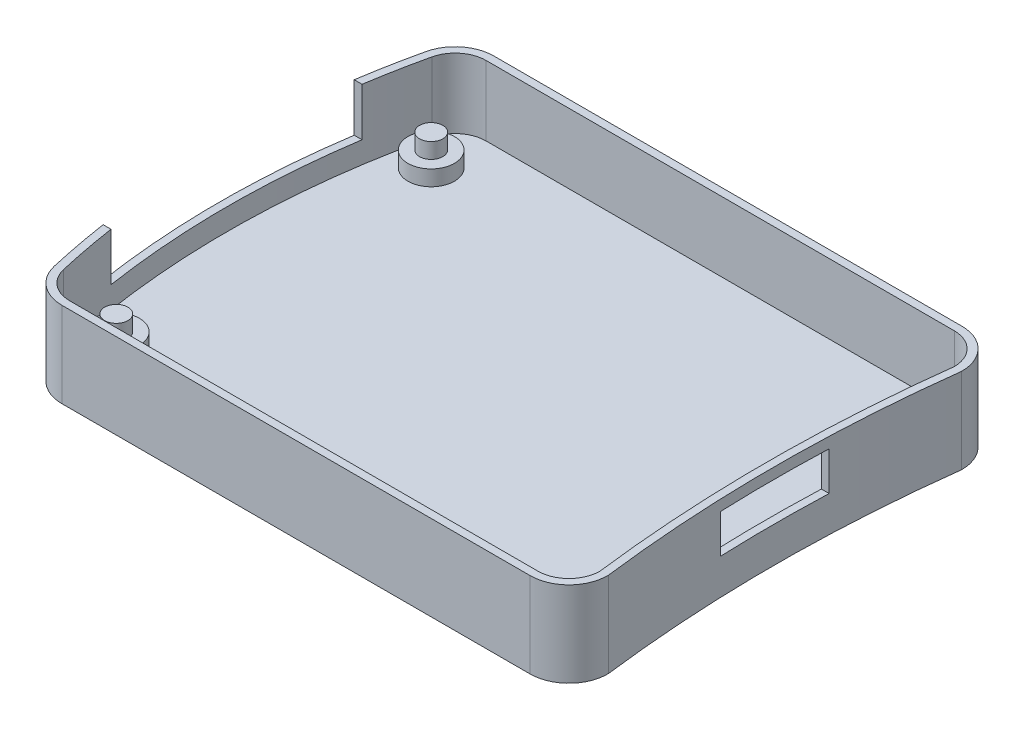
ISO-10303-21;
HEADER;
FILE_DESCRIPTION(('STEP AP214'),'2;1');
FILE_NAME('part.step','',(''),(''),'','','');
FILE_SCHEMA(('AUTOMOTIVE_DESIGN { 1 0 10303 214 1 1 1 1 }'));
ENDSEC;
DATA;
#1=APPLICATION_CONTEXT('core data for automotive mechanical design processes');
#2=APPLICATION_PROTOCOL_DEFINITION('international standard','automotive_design',2000,#1);
#3=PRODUCT_CONTEXT('',#1,'mechanical');
#4=PRODUCT('Part','Part','',(#3));
#5=PRODUCT_RELATED_PRODUCT_CATEGORY('part','',(#4));
#6=PRODUCT_DEFINITION_FORMATION('','',#4);
#7=PRODUCT_DEFINITION_CONTEXT('part definition',#1,'design');
#8=PRODUCT_DEFINITION('design','',#6,#7);
#9=PRODUCT_DEFINITION_SHAPE('','',#8);
#10=(LENGTH_UNIT() NAMED_UNIT(*) SI_UNIT(.MILLI.,.METRE.));
#11=(NAMED_UNIT(*) PLANE_ANGLE_UNIT() SI_UNIT($,.RADIAN.));
#12=(NAMED_UNIT(*) SI_UNIT($,.STERADIAN.) SOLID_ANGLE_UNIT());
#13=UNCERTAINTY_MEASURE_WITH_UNIT(LENGTH_MEASURE(1.E-05),#10,'distance_accuracy_value','');
#14=(GEOMETRIC_REPRESENTATION_CONTEXT(3) GLOBAL_UNCERTAINTY_ASSIGNED_CONTEXT((#13)) GLOBAL_UNIT_ASSIGNED_CONTEXT((#10,
#11,#12)) REPRESENTATION_CONTEXT('',''));
#15=CARTESIAN_POINT('',(0.,0.,0.));
#16=DIRECTION('',(0.,0.,1.));
#17=DIRECTION('',(1.,0.,0.));
#18=AXIS2_PLACEMENT_3D('',#15,#16,#17);
#19=CARTESIAN_POINT('',(217.327101265823,11.,0.));
#20=DIRECTION('',(0.,-1.,0.));
#21=DIRECTION('',(0.,0.,-1.));
#22=AXIS2_PLACEMENT_3D('',#19,#20,#21);
#23=CYLINDRICAL_SURFACE('',#22,184.259101265823);
#24=CARTESIAN_POINT('',(217.327101265823,2.,0.));
#25=DIRECTION('',(0.,-1.,0.));
#26=DIRECTION('',(0.,0.,1.));
#27=AXIS2_PLACEMENT_3D('',#24,#25,#26);
#28=CIRCLE('',#27,184.259101265823);
#29=CARTESIAN_POINT('',(34.4899801955874,2.,22.8473971829792));
#30=VERTEX_POINT('',#29);
#31=CARTESIAN_POINT('',(34.4899801955874,2.,-22.8473971829791));
#32=VERTEX_POINT('',#31);
#33=EDGE_CURVE('E242',#30,#32,#28,.T.);
#34=ORIENTED_EDGE('',*,*,#33,.F.);
#35=DIRECTION('',(0.,-1.,0.));
#36=VECTOR('',#35,1.);
#37=CARTESIAN_POINT('',(34.4899801955874,11.,22.8473971829792));
#38=LINE('',#37,#36);
#39=CARTESIAN_POINT('',(34.4899801955874,11.,22.8473971829792));
#40=VERTEX_POINT('',#39);
#41=EDGE_CURVE('E262',#40,#30,#38,.T.);
#42=ORIENTED_EDGE('',*,*,#41,.F.);
#43=CARTESIAN_POINT('',(217.327101265823,11.,0.));
#44=DIRECTION('',(0.,-1.,0.));
#45=DIRECTION('',(0.,0.,1.));
#46=AXIS2_PLACEMENT_3D('',#43,#44,#45);
#47=CIRCLE('',#46,184.259101265823);
#48=CARTESIAN_POINT('',(34.4899801955874,11.,-22.8473971829791));
#49=VERTEX_POINT('',#48);
#50=EDGE_CURVE('E243',#40,#49,#47,.T.);
#51=ORIENTED_EDGE('',*,*,#50,.T.);
#52=DIRECTION('',(0.,-1.,0.));
#53=VECTOR('',#52,1.);
#54=CARTESIAN_POINT('',(34.4899801955874,11.,-22.8473971829791));
#55=LINE('',#54,#53);
#56=EDGE_CURVE('E297',#49,#32,#55,.T.);
#57=ORIENTED_EDGE('',*,*,#56,.T.);
#58=EDGE_LOOP('',(#34,#42,#51,#57));
#59=FACE_BOUND('',#58,.T.);
#60=CARTESIAN_POINT('',(217.327101265823,4.6,0.));
#61=DIRECTION('',(0.,1.,0.));
#62=DIRECTION('',(0.,0.,1.));
#63=AXIS2_PLACEMENT_3D('',#60,#61,#62);
#64=CIRCLE('',#63,184.259101265823);
#65=CARTESIAN_POINT('',(33.2010129478207,4.6,7.));
#66=VERTEX_POINT('',#65);
#67=CARTESIAN_POINT('',(33.2010129478207,4.6,-7.));
#68=VERTEX_POINT('',#67);
#69=EDGE_CURVE('E230',#66,#68,#64,.F.);
#70=ORIENTED_EDGE('',*,*,#69,.T.);
#71=DIRECTION('',(0.,-1.,0.));
#72=VECTOR('',#71,1.);
#73=CARTESIAN_POINT('',(33.2010129478207,11.,-6.99999999999999));
#74=LINE('',#73,#72);
#75=CARTESIAN_POINT('',(33.2010129478207,9.6,-6.99999999999999));
#76=VERTEX_POINT('',#75);
#77=EDGE_CURVE('E239',#68,#76,#74,.F.);
#78=ORIENTED_EDGE('',*,*,#77,.T.);
#79=CARTESIAN_POINT('',(217.327101265823,9.6,0.));
#80=DIRECTION('',(0.,-1.,0.));
#81=DIRECTION('',(0.,0.,-1.));
#82=AXIS2_PLACEMENT_3D('',#79,#80,#81);
#83=CIRCLE('',#82,184.259101265823);
#84=CARTESIAN_POINT('',(33.2010129478207,9.6,7.));
#85=VERTEX_POINT('',#84);
#86=EDGE_CURVE('E236',#76,#85,#83,.F.);
#87=ORIENTED_EDGE('',*,*,#86,.T.);
#88=DIRECTION('',(0.,-1.,0.));
#89=VECTOR('',#88,1.);
#90=CARTESIAN_POINT('',(33.2010129478207,11.,7.00000000000001));
#91=LINE('',#90,#89);
#92=EDGE_CURVE('E233',#85,#66,#91,.T.);
#93=ORIENTED_EDGE('',*,*,#92,.T.);
#94=EDGE_LOOP('',(#70,#78,#87,#93));
#95=FACE_BOUND('',#94,.T.);
#96=ADVANCED_FACE('F35',(#59,#95),#23,.T.);
#97=CARTESIAN_POINT('',(217.327101265823,2.,0.));
#98=DIRECTION('',(0.,-1.,0.));
#99=DIRECTION('',(0.,0.,-1.));
#100=AXIS2_PLACEMENT_3D('',#97,#98,#99);
#101=CYLINDRICAL_SURFACE('',#100,183.259101265823);
#102=CARTESIAN_POINT('',(217.327101265823,0.,0.));
#103=DIRECTION('',(0.,-1.,0.));
#104=DIRECTION('',(0.,0.,1.));
#105=AXIS2_PLACEMENT_3D('',#102,#103,#104);
#106=CIRCLE('',#105,183.259101265823);
#107=CARTESIAN_POINT('',(35.4893636837968,0.,22.7801533754125));
#108=VERTEX_POINT('',#107);
#109=CARTESIAN_POINT('',(35.4893636837968,0.,-22.7801533754124));
#110=VERTEX_POINT('',#109);
#111=EDGE_CURVE('E390',#108,#110,#106,.T.);
#112=ORIENTED_EDGE('',*,*,#111,.T.);
#113=DIRECTION('',(0.,-1.,0.));
#114=VECTOR('',#113,1.);
#115=CARTESIAN_POINT('',(35.4893636837968,2.,-22.7801533754124));
#116=LINE('',#115,#114);
#117=CARTESIAN_POINT('',(35.489363683797,11.,-22.7801533754166));
#118=VERTEX_POINT('',#117);
#119=EDGE_CURVE('E392',#118,#110,#116,.T.);
#120=ORIENTED_EDGE('',*,*,#119,.F.);
#121=CARTESIAN_POINT('',(217.327101265823,11.,0.));
#122=DIRECTION('',(0.,-1.,0.));
#123=DIRECTION('',(0.,0.,1.));
#124=AXIS2_PLACEMENT_3D('',#121,#122,#123);
#125=CIRCLE('',#124,183.259101265823);
#126=CARTESIAN_POINT('',(35.489363683797,11.,22.7801533754166));
#127=VERTEX_POINT('',#126);
#128=EDGE_CURVE('E300',#127,#118,#125,.T.);
#129=ORIENTED_EDGE('',*,*,#128,.F.);
#130=DIRECTION('',(0.,-1.,0.));
#131=VECTOR('',#130,1.);
#132=CARTESIAN_POINT('',(35.4893636837968,2.,22.7801533754125));
#133=LINE('',#132,#131);
#134=EDGE_CURVE('E395',#127,#108,#133,.T.);
#135=ORIENTED_EDGE('',*,*,#134,.T.);
#136=EDGE_LOOP('',(#112,#120,#129,#135));
#137=FACE_BOUND('',#136,.T.);
#138=DIRECTION('',(0.,-1.,0.));
#139=VECTOR('',#138,1.);
#140=CARTESIAN_POINT('',(34.2017392955127,2.,-7.));
#141=LINE('',#140,#139);
#142=CARTESIAN_POINT('',(34.2017392955127,4.6,-7.));
#143=VERTEX_POINT('',#142);
#144=CARTESIAN_POINT('',(34.2017392955127,9.6,-6.99999999999999));
#145=VERTEX_POINT('',#144);
#146=EDGE_CURVE('E421',#143,#145,#141,.F.);
#147=ORIENTED_EDGE('',*,*,#146,.F.);
#148=CARTESIAN_POINT('',(217.327101265823,4.6,0.));
#149=DIRECTION('',(0.,1.,0.));
#150=DIRECTION('',(0.,0.,1.));
#151=AXIS2_PLACEMENT_3D('',#148,#149,#150);
#152=CIRCLE('',#151,183.259101265823);
#153=CARTESIAN_POINT('',(34.2017392955127,4.6,7.));
#154=VERTEX_POINT('',#153);
#155=EDGE_CURVE('E332',#154,#143,#152,.F.);
#156=ORIENTED_EDGE('',*,*,#155,.F.);
#157=DIRECTION('',(0.,-1.,0.));
#158=VECTOR('',#157,1.);
#159=CARTESIAN_POINT('',(34.2017392955127,2.,7.));
#160=LINE('',#159,#158);
#161=CARTESIAN_POINT('',(34.2017392955127,9.6,7.));
#162=VERTEX_POINT('',#161);
#163=EDGE_CURVE('E416',#162,#154,#160,.T.);
#164=ORIENTED_EDGE('',*,*,#163,.F.);
#165=CARTESIAN_POINT('',(217.327101265823,9.6,0.));
#166=DIRECTION('',(0.,-1.,0.));
#167=DIRECTION('',(0.,0.,-1.));
#168=AXIS2_PLACEMENT_3D('',#165,#166,#167);
#169=CIRCLE('',#168,183.259101265823);
#170=EDGE_CURVE('E419',#145,#162,#169,.F.);
#171=ORIENTED_EDGE('',*,*,#170,.F.);
#172=EDGE_LOOP('',(#147,#156,#164,#171));
#173=FACE_BOUND('',#172,.T.);
#174=ADVANCED_FACE('F459',(#137,#173),#101,.F.);
#175=CARTESIAN_POINT('',(30.48,2.,-22.86));
#176=DIRECTION('',(0.,1.,0.));
#177=DIRECTION('',(0.,0.,1.));
#178=AXIS2_PLACEMENT_3D('',#175,#176,#177);
#179=PLANE('',#178);
#180=CARTESIAN_POINT('',(-30.48,2.,-20.32));
#181=DIRECTION('',(0.,1.,0.));
#182=DIRECTION('',(0.,0.,1.));
#183=AXIS2_PLACEMENT_3D('',#180,#181,#182);
#184=CIRCLE('',#183,3.);
#185=CARTESIAN_POINT('',(-30.48,2.,-17.32));
#186=VERTEX_POINT('',#185);
#187=EDGE_CURVE('E367',#186,#186,#184,.T.);
#188=ORIENTED_EDGE('',*,*,#187,.F.);
#189=EDGE_LOOP('',(#188));
#190=FACE_BOUND('',#189,.T.);
#191=CARTESIAN_POINT('',(-30.48,2.,20.32));
#192=DIRECTION('',(0.,1.,0.));
#193=DIRECTION('',(0.,0.,1.));
#194=AXIS2_PLACEMENT_3D('',#191,#192,#193);
#195=CIRCLE('',#194,3.);
#196=CARTESIAN_POINT('',(-30.48,2.,23.32));
#197=VERTEX_POINT('',#196);
#198=EDGE_CURVE('E361',#197,#197,#195,.T.);
#199=ORIENTED_EDGE('',*,*,#198,.F.);
#200=EDGE_LOOP('',(#199));
#201=FACE_BOUND('',#200,.T.);
#202=CARTESIAN_POINT('',(30.48,2.,22.86));
#203=DIRECTION('',(0.,1.,0.));
#204=DIRECTION('',(0.,0.,1.));
#205=AXIS2_PLACEMENT_3D('',#202,#203,#204);
#206=CIRCLE('',#205,3.);
#207=CARTESIAN_POINT('',(30.48,2.,25.86));
#208=VERTEX_POINT('',#207);
#209=EDGE_CURVE('E355',#208,#208,#206,.T.);
#210=ORIENTED_EDGE('',*,*,#209,.F.);
#211=EDGE_LOOP('',(#210));
#212=FACE_BOUND('',#211,.T.);
#213=CARTESIAN_POINT('',(30.48,2.,-22.86));
#214=DIRECTION('',(0.,1.,0.));
#215=DIRECTION('',(0.,0.,1.));
#216=AXIS2_PLACEMENT_3D('',#213,#214,#215);
#217=CIRCLE('',#216,3.);
#218=CARTESIAN_POINT('',(30.48,2.,-19.86));
#219=VERTEX_POINT('',#218);
#220=EDGE_CURVE('E348',#219,#219,#217,.T.);
#221=ORIENTED_EDGE('',*,*,#220,.F.);
#222=EDGE_LOOP('',(#221));
#223=FACE_BOUND('',#222,.T.);
#224=ORIENTED_EDGE('',*,*,#33,.T.);
#225=CARTESIAN_POINT('',(30.48,2.,-22.86));
#226=DIRECTION('',(0.,1.,0.));
#227=DIRECTION('',(0.,0.,1.));
#228=AXIS2_PLACEMENT_3D('',#225,#226,#227);
#229=CIRCLE('',#228,4.00999999999999);
#230=CARTESIAN_POINT('',(30.48,2.,-26.87));
#231=VERTEX_POINT('',#230);
#232=EDGE_CURVE('E264',#32,#231,#229,.T.);
#233=ORIENTED_EDGE('',*,*,#232,.T.);
#234=DIRECTION('',(-1.,0.,0.));
#235=VECTOR('',#234,1.);
#236=CARTESIAN_POINT('',(30.48,2.,-26.87));
#237=LINE('',#236,#235);
#238=CARTESIAN_POINT('',(-29.941284626513,2.,-26.87));
#239=VERTEX_POINT('',#238);
#240=EDGE_CURVE('E266',#231,#239,#237,.T.);
#241=ORIENTED_EDGE('',*,*,#240,.T.);
#242=CARTESIAN_POINT('',(-29.941284626513,2.,-22.87));
#243=DIRECTION('',(0.,1.,0.));
#244=DIRECTION('',(0.,0.,1.));
#245=AXIS2_PLACEMENT_3D('',#242,#243,#244);
#246=CIRCLE('',#245,4.);
#247=CARTESIAN_POINT('',(-33.8406974313193,2.,-23.7613920449009));
#248=VERTEX_POINT('',#247);
#249=EDGE_CURVE('E268',#239,#248,#246,.T.);
#250=ORIENTED_EDGE('',*,*,#249,.T.);
#251=CARTESIAN_POINT('',(70.1040000000004,2.,0.));
#252=DIRECTION('',(0.,1.,0.));
#253=DIRECTION('',(0.,0.,1.));
#254=AXIS2_PLACEMENT_3D('',#251,#252,#253);
#255=CIRCLE('',#254,106.626);
#256=CARTESIAN_POINT('',(-33.8406974313193,2.,23.7613920449008));
#257=VERTEX_POINT('',#256);
#258=EDGE_CURVE('E270',#248,#257,#255,.T.);
#259=ORIENTED_EDGE('',*,*,#258,.T.);
#260=CARTESIAN_POINT('',(-29.941284626513,2.,22.87));
#261=DIRECTION('',(0.,1.,0.));
#262=DIRECTION('',(0.,0.,1.));
#263=AXIS2_PLACEMENT_3D('',#260,#261,#262);
#264=CIRCLE('',#263,4.00000000000001);
#265=CARTESIAN_POINT('',(-29.941284626513,2.,26.87));
#266=VERTEX_POINT('',#265);
#267=EDGE_CURVE('E272',#257,#266,#264,.T.);
#268=ORIENTED_EDGE('',*,*,#267,.T.);
#269=DIRECTION('',(1.,0.,0.));
#270=VECTOR('',#269,1.);
#271=CARTESIAN_POINT('',(-29.941284626513,2.,26.87));
#272=LINE('',#271,#270);
#273=CARTESIAN_POINT('',(30.48,2.,26.87));
#274=VERTEX_POINT('',#273);
#275=EDGE_CURVE('E274',#266,#274,#272,.T.);
#276=ORIENTED_EDGE('',*,*,#275,.T.);
#277=CARTESIAN_POINT('',(30.48,2.,22.86));
#278=DIRECTION('',(0.,1.,0.));
#279=DIRECTION('',(0.,0.,1.));
#280=AXIS2_PLACEMENT_3D('',#277,#278,#279);
#281=CIRCLE('',#280,4.01);
#282=EDGE_CURVE('E246',#274,#30,#281,.T.);
#283=ORIENTED_EDGE('',*,*,#282,.T.);
#284=EDGE_LOOP('',(#224,#233,#241,#250,#259,#268,#276,#283));
#285=FACE_BOUND('',#284,.T.);
#286=ADVANCED_FACE('F478',(#190,#201,#212,#223,#285),#179,.T.);
#287=CARTESIAN_POINT('',(-30.48,4.,-20.32));
#288=DIRECTION('',(0.,-1.,0.));
#289=DIRECTION('',(0.,0.,-1.));
#290=AXIS2_PLACEMENT_3D('',#287,#288,#289);
#291=CYLINDRICAL_SURFACE('',#290,3.);
#292=CARTESIAN_POINT('',(-30.48,4.,-20.32));
#293=DIRECTION('',(0.,1.,0.));
#294=DIRECTION('',(0.,0.,1.));
#295=AXIS2_PLACEMENT_3D('',#292,#293,#294);
#296=CIRCLE('',#295,3.);
#297=CARTESIAN_POINT('',(-30.48,4.,-17.32));
#298=VERTEX_POINT('',#297);
#299=EDGE_CURVE('E370',#298,#298,#296,.T.);
#300=ORIENTED_EDGE('',*,*,#299,.F.);
#301=EDGE_LOOP('',(#300));
#302=FACE_BOUND('',#301,.T.);
#303=ORIENTED_EDGE('',*,*,#187,.T.);
#304=EDGE_LOOP('',(#303));
#305=FACE_BOUND('',#304,.T.);
#306=ADVANCED_FACE('F547',(#302,#305),#291,.T.);
#307=CARTESIAN_POINT('',(-30.48,4.,-20.32));
#308=DIRECTION('',(0.,1.,0.));
#309=DIRECTION('',(0.,0.,1.));
#310=AXIS2_PLACEMENT_3D('',#307,#308,#309);
#311=PLANE('',#310);
#312=CARTESIAN_POINT('',(-30.48,4.,-20.32));
#313=DIRECTION('',(0.,1.,0.));
#314=DIRECTION('',(0.,0.,1.));
#315=AXIS2_PLACEMENT_3D('',#312,#313,#314);
#316=CIRCLE('',#315,1.5);
#317=CARTESIAN_POINT('',(-30.48,4.,-18.82));
#318=VERTEX_POINT('',#317);
#319=EDGE_CURVE('E345',#318,#318,#316,.T.);
#320=ORIENTED_EDGE('',*,*,#319,.F.);
#321=EDGE_LOOP('',(#320));
#322=FACE_BOUND('',#321,.T.);
#323=ORIENTED_EDGE('',*,*,#299,.T.);
#324=EDGE_LOOP('',(#323));
#325=FACE_BOUND('',#324,.T.);
#326=ADVANCED_FACE('F543',(#322,#325),#311,.T.);
#327=CARTESIAN_POINT('',(-30.48,4.,20.32));
#328=DIRECTION('',(0.,-1.,0.));
#329=DIRECTION('',(0.,0.,-1.));
#330=AXIS2_PLACEMENT_3D('',#327,#328,#329);
#331=CYLINDRICAL_SURFACE('',#330,3.);
#332=CARTESIAN_POINT('',(-30.48,4.,20.32));
#333=DIRECTION('',(0.,1.,0.));
#334=DIRECTION('',(0.,0.,1.));
#335=AXIS2_PLACEMENT_3D('',#332,#333,#334);
#336=CIRCLE('',#335,3.);
#337=CARTESIAN_POINT('',(-30.48,4.,23.32));
#338=VERTEX_POINT('',#337);
#339=EDGE_CURVE('E364',#338,#338,#336,.T.);
#340=ORIENTED_EDGE('',*,*,#339,.F.);
#341=EDGE_LOOP('',(#340));
#342=FACE_BOUND('',#341,.T.);
#343=ORIENTED_EDGE('',*,*,#198,.T.);
#344=EDGE_LOOP('',(#343));
#345=FACE_BOUND('',#344,.T.);
#346=ADVANCED_FACE('F539',(#342,#345),#331,.T.);
#347=CARTESIAN_POINT('',(-30.48,4.,20.32));
#348=DIRECTION('',(0.,1.,0.));
#349=DIRECTION('',(0.,0.,1.));
#350=AXIS2_PLACEMENT_3D('',#347,#348,#349);
#351=PLANE('',#350);
#352=CARTESIAN_POINT('',(-30.48,4.,20.32));
#353=DIRECTION('',(0.,1.,0.));
#354=DIRECTION('',(0.,0.,1.));
#355=AXIS2_PLACEMENT_3D('',#352,#353,#354);
#356=CIRCLE('',#355,1.5);
#357=CARTESIAN_POINT('',(-30.48,4.,21.82));
#358=VERTEX_POINT('',#357);
#359=EDGE_CURVE('E329',#358,#358,#356,.T.);
#360=ORIENTED_EDGE('',*,*,#359,.F.);
#361=EDGE_LOOP('',(#360));
#362=FACE_BOUND('',#361,.T.);
#363=ORIENTED_EDGE('',*,*,#339,.T.);
#364=EDGE_LOOP('',(#363));
#365=FACE_BOUND('',#364,.T.);
#366=ADVANCED_FACE('F535',(#362,#365),#351,.T.);
#367=CARTESIAN_POINT('',(30.48,4.,22.86));
#368=DIRECTION('',(0.,-1.,0.));
#369=DIRECTION('',(0.,0.,-1.));
#370=AXIS2_PLACEMENT_3D('',#367,#368,#369);
#371=CYLINDRICAL_SURFACE('',#370,3.);
#372=CARTESIAN_POINT('',(30.48,4.,22.86));
#373=DIRECTION('',(0.,1.,0.));
#374=DIRECTION('',(0.,0.,1.));
#375=AXIS2_PLACEMENT_3D('',#372,#373,#374);
#376=CIRCLE('',#375,3.);
#377=CARTESIAN_POINT('',(30.48,4.,25.86));
#378=VERTEX_POINT('',#377);
#379=EDGE_CURVE('E358',#378,#378,#376,.T.);
#380=ORIENTED_EDGE('',*,*,#379,.F.);
#381=EDGE_LOOP('',(#380));
#382=FACE_BOUND('',#381,.T.);
#383=ORIENTED_EDGE('',*,*,#209,.T.);
#384=EDGE_LOOP('',(#383));
#385=FACE_BOUND('',#384,.T.);
#386=ADVANCED_FACE('F531',(#382,#385),#371,.T.);
#387=CARTESIAN_POINT('',(30.48,4.,22.86));
#388=DIRECTION('',(0.,1.,0.));
#389=DIRECTION('',(0.,0.,1.));
#390=AXIS2_PLACEMENT_3D('',#387,#388,#389);
#391=PLANE('',#390);
#392=CARTESIAN_POINT('',(30.48,4.,22.86));
#393=DIRECTION('',(0.,1.,0.));
#394=DIRECTION('',(0.,0.,1.));
#395=AXIS2_PLACEMENT_3D('',#392,#393,#394);
#396=CIRCLE('',#395,1.5);
#397=CARTESIAN_POINT('',(30.48,4.,24.36));
#398=VERTEX_POINT('',#397);
#399=EDGE_CURVE('E333',#398,#398,#396,.T.);
#400=ORIENTED_EDGE('',*,*,#399,.F.);
#401=EDGE_LOOP('',(#400));
#402=FACE_BOUND('',#401,.T.);
#403=ORIENTED_EDGE('',*,*,#379,.T.);
#404=EDGE_LOOP('',(#403));
#405=FACE_BOUND('',#404,.T.);
#406=ADVANCED_FACE('F527',(#402,#405),#391,.T.);
#407=CARTESIAN_POINT('',(30.48,4.,-22.86));
#408=DIRECTION('',(0.,-1.,0.));
#409=DIRECTION('',(0.,0.,-1.));
#410=AXIS2_PLACEMENT_3D('',#407,#408,#409);
#411=CYLINDRICAL_SURFACE('',#410,3.);
#412=CARTESIAN_POINT('',(30.48,4.,-22.86));
#413=DIRECTION('',(0.,1.,0.));
#414=DIRECTION('',(0.,0.,1.));
#415=AXIS2_PLACEMENT_3D('',#412,#413,#414);
#416=CIRCLE('',#415,3.);
#417=CARTESIAN_POINT('',(30.48,4.,-19.86));
#418=VERTEX_POINT('',#417);
#419=EDGE_CURVE('E352',#418,#418,#416,.T.);
#420=ORIENTED_EDGE('',*,*,#419,.F.);
#421=EDGE_LOOP('',(#420));
#422=FACE_BOUND('',#421,.T.);
#423=ORIENTED_EDGE('',*,*,#220,.T.);
#424=EDGE_LOOP('',(#423));
#425=FACE_BOUND('',#424,.T.);
#426=ADVANCED_FACE('F523',(#422,#425),#411,.T.);
#427=CARTESIAN_POINT('',(30.48,4.,-22.86));
#428=DIRECTION('',(0.,1.,0.));
#429=DIRECTION('',(0.,0.,1.));
#430=AXIS2_PLACEMENT_3D('',#427,#428,#429);
#431=PLANE('',#430);
#432=CARTESIAN_POINT('',(30.48,4.,-22.86));
#433=DIRECTION('',(0.,1.,0.));
#434=DIRECTION('',(0.,0.,1.));
#435=AXIS2_PLACEMENT_3D('',#432,#433,#434);
#436=CIRCLE('',#435,1.5);
#437=CARTESIAN_POINT('',(30.48,4.,-21.36));
#438=VERTEX_POINT('',#437);
#439=EDGE_CURVE('E339',#438,#438,#436,.T.);
#440=ORIENTED_EDGE('',*,*,#439,.F.);
#441=EDGE_LOOP('',(#440));
#442=FACE_BOUND('',#441,.T.);
#443=ORIENTED_EDGE('',*,*,#419,.T.);
#444=EDGE_LOOP('',(#443));
#445=FACE_BOUND('',#444,.T.);
#446=ADVANCED_FACE('F519',(#442,#445),#431,.T.);
#447=CARTESIAN_POINT('',(-30.48,6.,-20.32));
#448=DIRECTION('',(0.,-1.,0.));
#449=DIRECTION('',(0.,0.,-1.));
#450=AXIS2_PLACEMENT_3D('',#447,#448,#449);
#451=CYLINDRICAL_SURFACE('',#450,1.5);
#452=CARTESIAN_POINT('',(-30.48,6.,-20.32));
#453=DIRECTION('',(0.,1.,0.));
#454=DIRECTION('',(0.,0.,1.));
#455=AXIS2_PLACEMENT_3D('',#452,#453,#454);
#456=CIRCLE('',#455,1.5);
#457=CARTESIAN_POINT('',(-30.48,6.,-18.82));
#458=VERTEX_POINT('',#457);
#459=EDGE_CURVE('E342',#458,#458,#456,.T.);
#460=ORIENTED_EDGE('',*,*,#459,.F.);
#461=EDGE_LOOP('',(#460));
#462=FACE_BOUND('',#461,.T.);
#463=ORIENTED_EDGE('',*,*,#319,.T.);
#464=EDGE_LOOP('',(#463));
#465=FACE_BOUND('',#464,.T.);
#466=ADVANCED_FACE('F515',(#462,#465),#451,.T.);
#467=CARTESIAN_POINT('',(-30.48,6.,-20.32));
#468=DIRECTION('',(0.,1.,0.));
#469=DIRECTION('',(0.,0.,1.));
#470=AXIS2_PLACEMENT_3D('',#467,#468,#469);
#471=PLANE('',#470);
#472=ORIENTED_EDGE('',*,*,#459,.T.);
#473=EDGE_LOOP('',(#472));
#474=FACE_BOUND('',#473,.T.);
#475=ADVANCED_FACE('F511',(#474),#471,.T.);
#476=CARTESIAN_POINT('',(30.48,6.,-22.86));
#477=DIRECTION('',(0.,-1.,0.));
#478=DIRECTION('',(0.,0.,-1.));
#479=AXIS2_PLACEMENT_3D('',#476,#477,#478);
#480=CYLINDRICAL_SURFACE('',#479,1.5);
#481=CARTESIAN_POINT('',(30.48,6.,-22.86));
#482=DIRECTION('',(0.,1.,0.));
#483=DIRECTION('',(0.,0.,1.));
#484=AXIS2_PLACEMENT_3D('',#481,#482,#483);
#485=CIRCLE('',#484,1.5);
#486=CARTESIAN_POINT('',(30.48,6.,-21.36));
#487=VERTEX_POINT('',#486);
#488=EDGE_CURVE('E336',#487,#487,#485,.T.);
#489=ORIENTED_EDGE('',*,*,#488,.F.);
#490=EDGE_LOOP('',(#489));
#491=FACE_BOUND('',#490,.T.);
#492=ORIENTED_EDGE('',*,*,#439,.T.);
#493=EDGE_LOOP('',(#492));
#494=FACE_BOUND('',#493,.T.);
#495=ADVANCED_FACE('F507',(#491,#494),#480,.T.);
#496=CARTESIAN_POINT('',(30.48,6.,-22.86));
#497=DIRECTION('',(0.,1.,0.));
#498=DIRECTION('',(0.,0.,1.));
#499=AXIS2_PLACEMENT_3D('',#496,#497,#498);
#500=PLANE('',#499);
#501=ORIENTED_EDGE('',*,*,#488,.T.);
#502=EDGE_LOOP('',(#501));
#503=FACE_BOUND('',#502,.T.);
#504=ADVANCED_FACE('F503',(#503),#500,.T.);
#505=CARTESIAN_POINT('',(30.48,6.,22.86));
#506=DIRECTION('',(0.,-1.,0.));
#507=DIRECTION('',(0.,0.,-1.));
#508=AXIS2_PLACEMENT_3D('',#505,#506,#507);
#509=CYLINDRICAL_SURFACE('',#508,1.5);
#510=CARTESIAN_POINT('',(30.48,6.,22.86));
#511=DIRECTION('',(0.,1.,0.));
#512=DIRECTION('',(0.,0.,1.));
#513=AXIS2_PLACEMENT_3D('',#510,#511,#512);
#514=CIRCLE('',#513,1.5);
#515=CARTESIAN_POINT('',(30.48,6.,24.36));
#516=VERTEX_POINT('',#515);
#517=EDGE_CURVE('E328',#516,#516,#514,.T.);
#518=ORIENTED_EDGE('',*,*,#517,.F.);
#519=EDGE_LOOP('',(#518));
#520=FACE_BOUND('',#519,.T.);
#521=ORIENTED_EDGE('',*,*,#399,.T.);
#522=EDGE_LOOP('',(#521));
#523=FACE_BOUND('',#522,.T.);
#524=ADVANCED_FACE('F499',(#520,#523),#509,.T.);
#525=CARTESIAN_POINT('',(30.48,6.,22.86));
#526=DIRECTION('',(0.,1.,0.));
#527=DIRECTION('',(0.,0.,1.));
#528=AXIS2_PLACEMENT_3D('',#525,#526,#527);
#529=PLANE('',#528);
#530=ORIENTED_EDGE('',*,*,#517,.T.);
#531=EDGE_LOOP('',(#530));
#532=FACE_BOUND('',#531,.T.);
#533=ADVANCED_FACE('F495',(#532),#529,.T.);
#534=CARTESIAN_POINT('',(-30.48,6.,20.32));
#535=DIRECTION('',(0.,-1.,0.));
#536=DIRECTION('',(0.,0.,-1.));
#537=AXIS2_PLACEMENT_3D('',#534,#535,#536);
#538=CYLINDRICAL_SURFACE('',#537,1.5);
#539=CARTESIAN_POINT('',(-30.48,6.,20.32));
#540=DIRECTION('',(0.,1.,0.));
#541=DIRECTION('',(0.,0.,1.));
#542=AXIS2_PLACEMENT_3D('',#539,#540,#541);
#543=CIRCLE('',#542,1.5);
#544=CARTESIAN_POINT('',(-30.48,6.,21.82));
#545=VERTEX_POINT('',#544);
#546=EDGE_CURVE('E325',#545,#545,#543,.T.);
#547=ORIENTED_EDGE('',*,*,#546,.F.);
#548=EDGE_LOOP('',(#547));
#549=FACE_BOUND('',#548,.T.);
#550=ORIENTED_EDGE('',*,*,#359,.T.);
#551=EDGE_LOOP('',(#550));
#552=FACE_BOUND('',#551,.T.);
#553=ADVANCED_FACE('F491',(#549,#552),#538,.T.);
#554=CARTESIAN_POINT('',(-30.48,6.,20.32));
#555=DIRECTION('',(0.,1.,0.));
#556=DIRECTION('',(0.,0.,1.));
#557=AXIS2_PLACEMENT_3D('',#554,#555,#556);
#558=PLANE('',#557);
#559=ORIENTED_EDGE('',*,*,#546,.T.);
#560=EDGE_LOOP('',(#559));
#561=FACE_BOUND('',#560,.T.);
#562=ADVANCED_FACE('F488',(#561),#558,.T.);
#563=CARTESIAN_POINT('',(217.327101265823,11.,0.));
#564=DIRECTION('',(0.,1.,0.));
#565=DIRECTION('',(0.,0.,1.));
#566=AXIS2_PLACEMENT_3D('',#563,#564,#565);
#567=PLANE('',#566);
#568=DIRECTION('',(1.,0.,0.));
#569=VECTOR('',#568,1.);
#570=CARTESIAN_POINT('',(-41.3948841669658,11.,16.2));
#571=LINE('',#570,#569);
#572=CARTESIAN_POINT('',(-36.2957926501739,11.,16.2));
#573=VERTEX_POINT('',#572);
#574=CARTESIAN_POINT('',(-35.2841581393279,11.,16.2));
#575=VERTEX_POINT('',#574);
#576=EDGE_CURVE('E201',#573,#575,#571,.T.);
#577=ORIENTED_EDGE('',*,*,#576,.F.);
#578=CARTESIAN_POINT('',(70.1040000000004,11.,0.));
#579=DIRECTION('',(0.,1.,0.));
#580=DIRECTION('',(0.,0.,1.));
#581=AXIS2_PLACEMENT_3D('',#578,#579,#580);
#582=CIRCLE('',#581,107.626);
#583=CARTESIAN_POINT('',(-34.8155506325209,11.,23.984240056126));
#584=VERTEX_POINT('',#583);
#585=EDGE_CURVE('E312',#573,#584,#582,.T.);
#586=ORIENTED_EDGE('',*,*,#585,.T.);
#587=CARTESIAN_POINT('',(-29.941284626513,11.,22.87));
#588=DIRECTION('',(0.,1.,0.));
#589=DIRECTION('',(0.,0.,1.));
#590=AXIS2_PLACEMENT_3D('',#587,#588,#589);
#591=CIRCLE('',#590,5.);
#592=CARTESIAN_POINT('',(-29.941284626513,11.,27.87));
#593=VERTEX_POINT('',#592);
#594=EDGE_CURVE('E316',#584,#593,#591,.T.);
#595=ORIENTED_EDGE('',*,*,#594,.T.);
#596=DIRECTION('',(1.,0.,0.));
#597=VECTOR('',#596,1.);
#598=CARTESIAN_POINT('',(-29.941284626513,11.,27.87));
#599=LINE('',#598,#597);
#600=CARTESIAN_POINT('',(30.48,11.,27.87));
#601=VERTEX_POINT('',#600);
#602=EDGE_CURVE('E319',#593,#601,#599,.T.);
#603=ORIENTED_EDGE('',*,*,#602,.T.);
#604=CARTESIAN_POINT('',(30.48,11.,22.86));
#605=DIRECTION('',(0.,1.,0.));
#606=DIRECTION('',(0.,0.,1.));
#607=AXIS2_PLACEMENT_3D('',#604,#605,#606);
#608=CIRCLE('',#607,5.01000000000019);
#609=EDGE_CURVE('E322',#601,#127,#608,.T.);
#610=ORIENTED_EDGE('',*,*,#609,.T.);
#611=ORIENTED_EDGE('',*,*,#128,.T.);
#612=CARTESIAN_POINT('',(30.48,11.,-22.86));
#613=DIRECTION('',(0.,1.,0.));
#614=DIRECTION('',(0.,0.,1.));
#615=AXIS2_PLACEMENT_3D('',#612,#613,#614);
#616=CIRCLE('',#615,5.01000000000019);
#617=CARTESIAN_POINT('',(30.48,11.,-27.8700000000002));
#618=VERTEX_POINT('',#617);
#619=EDGE_CURVE('E303',#118,#618,#616,.T.);
#620=ORIENTED_EDGE('',*,*,#619,.T.);
#621=DIRECTION('',(-1.,0.,0.));
#622=VECTOR('',#621,1.);
#623=CARTESIAN_POINT('',(30.48,11.,-27.87));
#624=LINE('',#623,#622);
#625=CARTESIAN_POINT('',(-29.941284626513,11.,-27.87));
#626=VERTEX_POINT('',#625);
#627=EDGE_CURVE('E306',#618,#626,#624,.T.);
#628=ORIENTED_EDGE('',*,*,#627,.T.);
#629=CARTESIAN_POINT('',(-29.941284626513,11.,-22.87));
#630=DIRECTION('',(0.,1.,0.));
#631=DIRECTION('',(0.,0.,1.));
#632=AXIS2_PLACEMENT_3D('',#629,#630,#631);
#633=CIRCLE('',#632,5.);
#634=CARTESIAN_POINT('',(-34.8155506325209,11.,-23.9842400561261));
#635=VERTEX_POINT('',#634);
#636=EDGE_CURVE('E309',#626,#635,#633,.T.);
#637=ORIENTED_EDGE('',*,*,#636,.T.);
#638=CARTESIAN_POINT('',(-36.2957926501739,11.,-16.2));
#639=VERTEX_POINT('',#638);
#640=EDGE_CURVE('E313',#635,#639,#582,.T.);
#641=ORIENTED_EDGE('',*,*,#640,.T.);
#642=DIRECTION('',(-1.,0.,0.));
#643=VECTOR('',#642,1.);
#644=CARTESIAN_POINT('',(-41.3948841669658,11.,-16.2));
#645=LINE('',#644,#643);
#646=CARTESIAN_POINT('',(-35.2841581393279,11.,-16.2));
#647=VERTEX_POINT('',#646);
#648=EDGE_CURVE('E433',#647,#639,#645,.T.);
#649=ORIENTED_EDGE('',*,*,#648,.F.);
#650=CARTESIAN_POINT('',(70.1040000000004,11.,0.));
#651=DIRECTION('',(0.,1.,0.));
#652=DIRECTION('',(0.,0.,1.));
#653=AXIS2_PLACEMENT_3D('',#650,#651,#652);
#654=CIRCLE('',#653,106.626);
#655=CARTESIAN_POINT('',(-33.8406974313193,11.,-23.7613920449009));
#656=VERTEX_POINT('',#655);
#657=EDGE_CURVE('E253',#656,#647,#654,.T.);
#658=ORIENTED_EDGE('',*,*,#657,.F.);
#659=CARTESIAN_POINT('',(-29.941284626513,11.,-22.87));
#660=DIRECTION('',(0.,1.,0.));
#661=DIRECTION('',(0.,0.,1.));
#662=AXIS2_PLACEMENT_3D('',#659,#660,#661);
#663=CIRCLE('',#662,4.);
#664=CARTESIAN_POINT('',(-29.941284626513,11.,-26.87));
#665=VERTEX_POINT('',#664);
#666=EDGE_CURVE('E250',#665,#656,#663,.T.);
#667=ORIENTED_EDGE('',*,*,#666,.F.);
#668=DIRECTION('',(-1.,0.,0.));
#669=VECTOR('',#668,1.);
#670=CARTESIAN_POINT('',(30.48,11.,-26.87));
#671=LINE('',#670,#669);
#672=CARTESIAN_POINT('',(30.48,11.,-26.87));
#673=VERTEX_POINT('',#672);
#674=EDGE_CURVE('E248',#673,#665,#671,.T.);
#675=ORIENTED_EDGE('',*,*,#674,.F.);
#676=CARTESIAN_POINT('',(30.48,11.,-22.86));
#677=DIRECTION('',(0.,1.,0.));
#678=DIRECTION('',(0.,0.,1.));
#679=AXIS2_PLACEMENT_3D('',#676,#677,#678);
#680=CIRCLE('',#679,4.00999999999999);
#681=EDGE_CURVE('E245',#49,#673,#680,.T.);
#682=ORIENTED_EDGE('',*,*,#681,.F.);
#683=ORIENTED_EDGE('',*,*,#50,.F.);
#684=CARTESIAN_POINT('',(30.48,11.,22.86));
#685=DIRECTION('',(0.,1.,0.));
#686=DIRECTION('',(0.,0.,1.));
#687=AXIS2_PLACEMENT_3D('',#684,#685,#686);
#688=CIRCLE('',#687,4.01);
#689=CARTESIAN_POINT('',(30.48,11.,26.87));
#690=VERTEX_POINT('',#689);
#691=EDGE_CURVE('E260',#690,#40,#688,.T.);
#692=ORIENTED_EDGE('',*,*,#691,.F.);
#693=DIRECTION('',(1.,0.,0.));
#694=VECTOR('',#693,1.);
#695=CARTESIAN_POINT('',(-29.941284626513,11.,26.87));
#696=LINE('',#695,#694);
#697=CARTESIAN_POINT('',(-29.941284626513,11.,26.87));
#698=VERTEX_POINT('',#697);
#699=EDGE_CURVE('E257',#698,#690,#696,.T.);
#700=ORIENTED_EDGE('',*,*,#699,.F.);
#701=CARTESIAN_POINT('',(-29.941284626513,11.,22.87));
#702=DIRECTION('',(0.,1.,0.));
#703=DIRECTION('',(0.,0.,1.));
#704=AXIS2_PLACEMENT_3D('',#701,#702,#703);
#705=CIRCLE('',#704,4.00000000000001);
#706=CARTESIAN_POINT('',(-33.8406974313193,11.,23.7613920449008));
#707=VERTEX_POINT('',#706);
#708=EDGE_CURVE('E255',#707,#698,#705,.T.);
#709=ORIENTED_EDGE('',*,*,#708,.F.);
#710=EDGE_CURVE('E252',#575,#707,#654,.T.);
#711=ORIENTED_EDGE('',*,*,#710,.F.);
#712=EDGE_LOOP('',(#577,#586,#595,#603,#610,#611,#620,#628,#637,#641,#649,#658,#667,#675,#682,
#683,#692,#700,#709,#711));
#713=FACE_BOUND('',#712,.T.);
#714=ADVANCED_FACE('F431',(#713),#567,.T.);
#715=CARTESIAN_POINT('',(30.48,11.,-22.86));
#716=DIRECTION('',(0.,-1.,0.));
#717=DIRECTION('',(0.,0.,-1.));
#718=AXIS2_PLACEMENT_3D('',#715,#716,#717);
#719=CYLINDRICAL_SURFACE('',#718,4.00999999999999);
#720=ORIENTED_EDGE('',*,*,#232,.F.);
#721=ORIENTED_EDGE('',*,*,#56,.F.);
#722=ORIENTED_EDGE('',*,*,#681,.T.);
#723=DIRECTION('',(0.,-1.,0.));
#724=VECTOR('',#723,1.);
#725=CARTESIAN_POINT('',(30.48,11.,-26.87));
#726=LINE('',#725,#724);
#727=EDGE_CURVE('E294',#673,#231,#726,.T.);
#728=ORIENTED_EDGE('',*,*,#727,.T.);
#729=EDGE_LOOP('',(#720,#721,#722,#728));
#730=FACE_BOUND('',#729,.T.);
#731=ADVANCED_FACE('F484',(#730),#719,.F.);
#732=CARTESIAN_POINT('',(30.48,11.,-26.87));
#733=DIRECTION('',(0.,0.,1.));
#734=DIRECTION('',(1.,0.,0.));
#735=AXIS2_PLACEMENT_3D('',#732,#733,#734);
#736=PLANE('',#735);
#737=ORIENTED_EDGE('',*,*,#240,.F.);
#738=ORIENTED_EDGE('',*,*,#727,.F.);
#739=ORIENTED_EDGE('',*,*,#674,.T.);
#740=DIRECTION('',(0.,-1.,0.));
#741=VECTOR('',#740,1.);
#742=CARTESIAN_POINT('',(-29.941284626513,11.,-26.87));
#743=LINE('',#742,#741);
#744=EDGE_CURVE('E291',#665,#239,#743,.T.);
#745=ORIENTED_EDGE('',*,*,#744,.T.);
#746=EDGE_LOOP('',(#737,#738,#739,#745));
#747=FACE_BOUND('',#746,.T.);
#748=ADVANCED_FACE('F824',(#747),#736,.T.);
#749=CARTESIAN_POINT('',(-29.941284626513,11.,-22.87));
#750=DIRECTION('',(0.,-1.,0.));
#751=DIRECTION('',(0.,0.,-1.));
#752=AXIS2_PLACEMENT_3D('',#749,#750,#751);
#753=CYLINDRICAL_SURFACE('',#752,4.);
#754=ORIENTED_EDGE('',*,*,#249,.F.);
#755=ORIENTED_EDGE('',*,*,#744,.F.);
#756=ORIENTED_EDGE('',*,*,#666,.T.);
#757=DIRECTION('',(0.,-1.,0.));
#758=VECTOR('',#757,1.);
#759=CARTESIAN_POINT('',(-33.8406974313193,11.,-23.7613920449009));
#760=LINE('',#759,#758);
#761=EDGE_CURVE('E288',#656,#248,#760,.T.);
#762=ORIENTED_EDGE('',*,*,#761,.T.);
#763=EDGE_LOOP('',(#754,#755,#756,#762));
#764=FACE_BOUND('',#763,.T.);
#765=ADVANCED_FACE('F659',(#764),#753,.F.);
#766=CARTESIAN_POINT('',(70.1040000000004,11.,0.));
#767=DIRECTION('',(0.,-1.,0.));
#768=DIRECTION('',(0.,0.,-1.));
#769=AXIS2_PLACEMENT_3D('',#766,#767,#768);
#770=CYLINDRICAL_SURFACE('',#769,106.626);
#771=DIRECTION('',(0.,-1.,0.));
#772=VECTOR('',#771,1.);
#773=CARTESIAN_POINT('',(-35.2841581393279,11.,16.2));
#774=LINE('',#773,#772);
#775=CARTESIAN_POINT('',(-35.2841581393279,4.8,16.2));
#776=VERTEX_POINT('',#775);
#777=EDGE_CURVE('E196',#575,#776,#774,.T.);
#778=ORIENTED_EDGE('',*,*,#777,.F.);
#779=ORIENTED_EDGE('',*,*,#710,.T.);
#780=DIRECTION('',(0.,-1.,0.));
#781=VECTOR('',#780,1.);
#782=CARTESIAN_POINT('',(-33.8406974313193,11.,23.7613920449008));
#783=LINE('',#782,#781);
#784=EDGE_CURVE('E285',#707,#257,#783,.T.);
#785=ORIENTED_EDGE('',*,*,#784,.T.);
#786=ORIENTED_EDGE('',*,*,#258,.F.);
#787=ORIENTED_EDGE('',*,*,#761,.F.);
#788=ORIENTED_EDGE('',*,*,#657,.T.);
#789=DIRECTION('',(0.,-1.,0.));
#790=VECTOR('',#789,1.);
#791=CARTESIAN_POINT('',(-35.2841581393279,11.,-16.2));
#792=LINE('',#791,#790);
#793=CARTESIAN_POINT('',(-35.2841581393279,4.8,-16.2));
#794=VERTEX_POINT('',#793);
#795=EDGE_CURVE('E205',#794,#647,#792,.F.);
#796=ORIENTED_EDGE('',*,*,#795,.F.);
#797=CARTESIAN_POINT('',(70.1040000000004,4.8,0.));
#798=DIRECTION('',(0.,1.,0.));
#799=DIRECTION('',(0.,0.,1.));
#800=AXIS2_PLACEMENT_3D('',#797,#798,#799);
#801=CIRCLE('',#800,106.626);
#802=EDGE_CURVE('E208',#794,#776,#801,.T.);
#803=ORIENTED_EDGE('',*,*,#802,.T.);
#804=EDGE_LOOP('',(#778,#779,#785,#786,#787,#788,#796,#803));
#805=FACE_BOUND('',#804,.T.);
#806=ADVANCED_FACE('F213',(#805),#770,.F.);
#807=CARTESIAN_POINT('',(-29.941284626513,11.,22.87));
#808=DIRECTION('',(0.,-1.,0.));
#809=DIRECTION('',(0.,0.,-1.));
#810=AXIS2_PLACEMENT_3D('',#807,#808,#809);
#811=CYLINDRICAL_SURFACE('',#810,4.00000000000001);
#812=ORIENTED_EDGE('',*,*,#267,.F.);
#813=ORIENTED_EDGE('',*,*,#784,.F.);
#814=ORIENTED_EDGE('',*,*,#708,.T.);
#815=DIRECTION('',(0.,-1.,0.));
#816=VECTOR('',#815,1.);
#817=CARTESIAN_POINT('',(-29.941284626513,11.,26.87));
#818=LINE('',#817,#816);
#819=EDGE_CURVE('E282',#698,#266,#818,.T.);
#820=ORIENTED_EDGE('',*,*,#819,.T.);
#821=EDGE_LOOP('',(#812,#813,#814,#820));
#822=FACE_BOUND('',#821,.T.);
#823=ADVANCED_FACE('F658',(#822),#811,.F.);
#824=CARTESIAN_POINT('',(-29.941284626513,11.,26.87));
#825=DIRECTION('',(0.,0.,-1.));
#826=DIRECTION('',(-1.,0.,0.));
#827=AXIS2_PLACEMENT_3D('',#824,#825,#826);
#828=PLANE('',#827);
#829=ORIENTED_EDGE('',*,*,#275,.F.);
#830=ORIENTED_EDGE('',*,*,#819,.F.);
#831=ORIENTED_EDGE('',*,*,#699,.T.);
#832=DIRECTION('',(0.,-1.,0.));
#833=VECTOR('',#832,1.);
#834=CARTESIAN_POINT('',(30.48,11.,26.87));
#835=LINE('',#834,#833);
#836=EDGE_CURVE('E279',#690,#274,#835,.T.);
#837=ORIENTED_EDGE('',*,*,#836,.T.);
#838=EDGE_LOOP('',(#829,#830,#831,#837));
#839=FACE_BOUND('',#838,.T.);
#840=ADVANCED_FACE('F674',(#839),#828,.T.);
#841=CARTESIAN_POINT('',(30.48,11.,22.86));
#842=DIRECTION('',(0.,-1.,0.));
#843=DIRECTION('',(0.,0.,-1.));
#844=AXIS2_PLACEMENT_3D('',#841,#842,#843);
#845=CYLINDRICAL_SURFACE('',#844,4.01);
#846=ORIENTED_EDGE('',*,*,#282,.F.);
#847=ORIENTED_EDGE('',*,*,#836,.F.);
#848=ORIENTED_EDGE('',*,*,#691,.T.);
#849=ORIENTED_EDGE('',*,*,#41,.T.);
#850=EDGE_LOOP('',(#846,#847,#848,#849));
#851=FACE_BOUND('',#850,.T.);
#852=ADVANCED_FACE('F556',(#851),#845,.F.);
#853=CARTESIAN_POINT('',(30.48,0.,-22.86));
#854=DIRECTION('',(0.,1.,0.));
#855=DIRECTION('',(0.,0.,1.));
#856=AXIS2_PLACEMENT_3D('',#853,#854,#855);
#857=PLANE('',#856);
#858=CARTESIAN_POINT('',(30.48,0.,-22.86));
#859=DIRECTION('',(0.,1.,0.));
#860=DIRECTION('',(0.,0.,1.));
#861=AXIS2_PLACEMENT_3D('',#858,#859,#860);
#862=CIRCLE('',#861,5.00999999999999);
#863=CARTESIAN_POINT('',(30.48,0.,-27.87));
#864=VERTEX_POINT('',#863);
#865=EDGE_CURVE('E373',#110,#864,#862,.T.);
#866=ORIENTED_EDGE('',*,*,#865,.F.);
#867=ORIENTED_EDGE('',*,*,#111,.F.);
#868=CARTESIAN_POINT('',(30.48,0.,22.86));
#869=DIRECTION('',(0.,1.,0.));
#870=DIRECTION('',(0.,0.,1.));
#871=AXIS2_PLACEMENT_3D('',#868,#869,#870);
#872=CIRCLE('',#871,5.01);
#873=CARTESIAN_POINT('',(30.48,0.,27.87));
#874=VERTEX_POINT('',#873);
#875=EDGE_CURVE('E388',#874,#108,#872,.T.);
#876=ORIENTED_EDGE('',*,*,#875,.F.);
#877=DIRECTION('',(1.,0.,0.));
#878=VECTOR('',#877,1.);
#879=CARTESIAN_POINT('',(-29.941284626513,0.,27.87));
#880=LINE('',#879,#878);
#881=CARTESIAN_POINT('',(-29.941284626513,0.,27.87));
#882=VERTEX_POINT('',#881);
#883=EDGE_CURVE('E386',#882,#874,#880,.T.);
#884=ORIENTED_EDGE('',*,*,#883,.F.);
#885=CARTESIAN_POINT('',(-29.941284626513,0.,22.87));
#886=DIRECTION('',(0.,1.,0.));
#887=DIRECTION('',(0.,0.,1.));
#888=AXIS2_PLACEMENT_3D('',#885,#886,#887);
#889=CIRCLE('',#888,5.00000000000001);
#890=CARTESIAN_POINT('',(-34.8155506325209,0.,23.9842400561261));
#891=VERTEX_POINT('',#890);
#892=EDGE_CURVE('E384',#891,#882,#889,.T.);
#893=ORIENTED_EDGE('',*,*,#892,.F.);
#894=CARTESIAN_POINT('',(70.1040000000004,0.,0.));
#895=DIRECTION('',(0.,1.,0.));
#896=DIRECTION('',(0.,0.,1.));
#897=AXIS2_PLACEMENT_3D('',#894,#895,#896);
#898=CIRCLE('',#897,107.626);
#899=CARTESIAN_POINT('',(-34.8155506325209,0.,-23.9842400561261));
#900=VERTEX_POINT('',#899);
#901=EDGE_CURVE('E382',#900,#891,#898,.T.);
#902=ORIENTED_EDGE('',*,*,#901,.F.);
#903=CARTESIAN_POINT('',(-29.941284626513,0.,-22.87));
#904=DIRECTION('',(0.,1.,0.));
#905=DIRECTION('',(0.,0.,1.));
#906=AXIS2_PLACEMENT_3D('',#903,#904,#905);
#907=CIRCLE('',#906,5.00000000000001);
#908=CARTESIAN_POINT('',(-29.941284626513,0.,-27.87));
#909=VERTEX_POINT('',#908);
#910=EDGE_CURVE('E380',#909,#900,#907,.T.);
#911=ORIENTED_EDGE('',*,*,#910,.F.);
#912=DIRECTION('',(-1.,0.,0.));
#913=VECTOR('',#912,1.);
#914=CARTESIAN_POINT('',(30.48,0.,-27.87));
#915=LINE('',#914,#913);
#916=EDGE_CURVE('E378',#864,#909,#915,.T.);
#917=ORIENTED_EDGE('',*,*,#916,.F.);
#918=EDGE_LOOP('',(#866,#867,#876,#884,#893,#902,#911,#917));
#919=FACE_BOUND('',#918,.T.);
#920=ADVANCED_FACE('F444',(#919),#857,.F.);
#921=CARTESIAN_POINT('',(30.48,2.,22.86));
#922=DIRECTION('',(0.,-1.,0.));
#923=DIRECTION('',(0.,0.,-1.));
#924=AXIS2_PLACEMENT_3D('',#921,#922,#923);
#925=CYLINDRICAL_SURFACE('',#924,5.01);
#926=ORIENTED_EDGE('',*,*,#875,.T.);
#927=ORIENTED_EDGE('',*,*,#134,.F.);
#928=ORIENTED_EDGE('',*,*,#609,.F.);
#929=DIRECTION('',(0.,-1.,0.));
#930=VECTOR('',#929,1.);
#931=CARTESIAN_POINT('',(30.48,2.,27.87));
#932=LINE('',#931,#930);
#933=EDGE_CURVE('E398',#601,#874,#932,.T.);
#934=ORIENTED_EDGE('',*,*,#933,.T.);
#935=EDGE_LOOP('',(#926,#927,#928,#934));
#936=FACE_BOUND('',#935,.T.);
#937=ADVANCED_FACE('F456',(#936),#925,.T.);
#938=CARTESIAN_POINT('',(-29.941284626513,2.,27.87));
#939=DIRECTION('',(0.,0.,-1.));
#940=DIRECTION('',(-1.,0.,0.));
#941=AXIS2_PLACEMENT_3D('',#938,#939,#940);
#942=PLANE('',#941);
#943=ORIENTED_EDGE('',*,*,#883,.T.);
#944=ORIENTED_EDGE('',*,*,#933,.F.);
#945=ORIENTED_EDGE('',*,*,#602,.F.);
#946=DIRECTION('',(0.,-1.,0.));
#947=VECTOR('',#946,1.);
#948=CARTESIAN_POINT('',(-29.941284626513,2.,27.87));
#949=LINE('',#948,#947);
#950=EDGE_CURVE('E401',#593,#882,#949,.T.);
#951=ORIENTED_EDGE('',*,*,#950,.T.);
#952=EDGE_LOOP('',(#943,#944,#945,#951));
#953=FACE_BOUND('',#952,.T.);
#954=ADVANCED_FACE('F452',(#953),#942,.F.);
#955=CARTESIAN_POINT('',(-29.941284626513,2.,22.87));
#956=DIRECTION('',(0.,-1.,0.));
#957=DIRECTION('',(0.,0.,-1.));
#958=AXIS2_PLACEMENT_3D('',#955,#956,#957);
#959=CYLINDRICAL_SURFACE('',#958,5.00000000000001);
#960=ORIENTED_EDGE('',*,*,#892,.T.);
#961=ORIENTED_EDGE('',*,*,#950,.F.);
#962=ORIENTED_EDGE('',*,*,#594,.F.);
#963=DIRECTION('',(0.,-1.,0.));
#964=VECTOR('',#963,1.);
#965=CARTESIAN_POINT('',(-34.8155506325209,2.,23.9842400561261));
#966=LINE('',#965,#964);
#967=EDGE_CURVE('E404',#584,#891,#966,.T.);
#968=ORIENTED_EDGE('',*,*,#967,.T.);
#969=EDGE_LOOP('',(#960,#961,#962,#968));
#970=FACE_BOUND('',#969,.T.);
#971=ADVANCED_FACE('F448',(#970),#959,.T.);
#972=CARTESIAN_POINT('',(70.1040000000004,2.,0.));
#973=DIRECTION('',(0.,-1.,0.));
#974=DIRECTION('',(0.,0.,-1.));
#975=AXIS2_PLACEMENT_3D('',#972,#973,#974);
#976=CYLINDRICAL_SURFACE('',#975,107.626);
#977=ORIENTED_EDGE('',*,*,#585,.F.);
#978=DIRECTION('',(0.,-1.,0.));
#979=VECTOR('',#978,1.);
#980=CARTESIAN_POINT('',(-36.2957926501739,2.,16.2));
#981=LINE('',#980,#979);
#982=CARTESIAN_POINT('',(-36.2957926501739,4.8,16.2));
#983=VERTEX_POINT('',#982);
#984=EDGE_CURVE('E13',#573,#983,#981,.T.);
#985=ORIENTED_EDGE('',*,*,#984,.T.);
#986=CARTESIAN_POINT('',(70.1040000000004,4.8,0.));
#987=DIRECTION('',(0.,1.,0.));
#988=DIRECTION('',(0.,0.,1.));
#989=AXIS2_PLACEMENT_3D('',#986,#987,#988);
#990=CIRCLE('',#989,107.626);
#991=CARTESIAN_POINT('',(-36.2957926501739,4.8,-16.2));
#992=VERTEX_POINT('',#991);
#993=EDGE_CURVE('E210',#992,#983,#990,.T.);
#994=ORIENTED_EDGE('',*,*,#993,.F.);
#995=DIRECTION('',(0.,-1.,0.));
#996=VECTOR('',#995,1.);
#997=CARTESIAN_POINT('',(-36.2957926501739,2.,-16.2));
#998=LINE('',#997,#996);
#999=EDGE_CURVE('E43',#992,#639,#998,.F.);
#1000=ORIENTED_EDGE('',*,*,#999,.T.);
#1001=ORIENTED_EDGE('',*,*,#640,.F.);
#1002=DIRECTION('',(0.,-1.,0.));
#1003=VECTOR('',#1002,1.);
#1004=CARTESIAN_POINT('',(-34.8155506325209,2.,-23.9842400561261));
#1005=LINE('',#1004,#1003);
#1006=EDGE_CURVE('E407',#635,#900,#1005,.T.);
#1007=ORIENTED_EDGE('',*,*,#1006,.T.);
#1008=ORIENTED_EDGE('',*,*,#901,.T.);
#1009=ORIENTED_EDGE('',*,*,#967,.F.);
#1010=EDGE_LOOP('',(#977,#985,#994,#1000,#1001,#1007,#1008,#1009));
#1011=FACE_BOUND('',#1010,.T.);
#1012=ADVANCED_FACE('F427',(#1011),#976,.T.);
#1013=CARTESIAN_POINT('',(-29.941284626513,2.,-22.87));
#1014=DIRECTION('',(0.,-1.,0.));
#1015=DIRECTION('',(0.,0.,-1.));
#1016=AXIS2_PLACEMENT_3D('',#1013,#1014,#1015);
#1017=CYLINDRICAL_SURFACE('',#1016,5.00000000000001);
#1018=ORIENTED_EDGE('',*,*,#910,.T.);
#1019=ORIENTED_EDGE('',*,*,#1006,.F.);
#1020=ORIENTED_EDGE('',*,*,#636,.F.);
#1021=DIRECTION('',(0.,-1.,0.));
#1022=VECTOR('',#1021,1.);
#1023=CARTESIAN_POINT('',(-29.941284626513,2.,-27.87));
#1024=LINE('',#1023,#1022);
#1025=EDGE_CURVE('E410',#626,#909,#1024,.T.);
#1026=ORIENTED_EDGE('',*,*,#1025,.T.);
#1027=EDGE_LOOP('',(#1018,#1019,#1020,#1026));
#1028=FACE_BOUND('',#1027,.T.);
#1029=ADVANCED_FACE('F437',(#1028),#1017,.T.);
#1030=CARTESIAN_POINT('',(30.48,2.,-27.87));
#1031=DIRECTION('',(0.,0.,1.));
#1032=DIRECTION('',(1.,0.,0.));
#1033=AXIS2_PLACEMENT_3D('',#1030,#1031,#1032);
#1034=PLANE('',#1033);
#1035=ORIENTED_EDGE('',*,*,#916,.T.);
#1036=ORIENTED_EDGE('',*,*,#1025,.F.);
#1037=ORIENTED_EDGE('',*,*,#627,.F.);
#1038=DIRECTION('',(0.,-1.,0.));
#1039=VECTOR('',#1038,1.);
#1040=CARTESIAN_POINT('',(30.48,2.,-27.87));
#1041=LINE('',#1040,#1039);
#1042=EDGE_CURVE('E351',#618,#864,#1041,.T.);
#1043=ORIENTED_EDGE('',*,*,#1042,.T.);
#1044=EDGE_LOOP('',(#1035,#1036,#1037,#1043));
#1045=FACE_BOUND('',#1044,.T.);
#1046=ADVANCED_FACE('F464',(#1045),#1034,.F.);
#1047=CARTESIAN_POINT('',(30.48,2.,-22.86));
#1048=DIRECTION('',(0.,-1.,0.));
#1049=DIRECTION('',(0.,0.,-1.));
#1050=AXIS2_PLACEMENT_3D('',#1047,#1048,#1049);
#1051=CYLINDRICAL_SURFACE('',#1050,5.00999999999999);
#1052=ORIENTED_EDGE('',*,*,#865,.T.);
#1053=ORIENTED_EDGE('',*,*,#1042,.F.);
#1054=ORIENTED_EDGE('',*,*,#619,.F.);
#1055=ORIENTED_EDGE('',*,*,#119,.T.);
#1056=EDGE_LOOP('',(#1052,#1053,#1054,#1055));
#1057=FACE_BOUND('',#1056,.T.);
#1058=ADVANCED_FACE('F37',(#1057),#1051,.T.);
#1059=CARTESIAN_POINT('',(44.068,9.6,-6.99999999999999));
#1060=DIRECTION('',(0.,0.,1.));
#1061=DIRECTION('',(0.,-1.,0.));
#1062=AXIS2_PLACEMENT_3D('',#1059,#1060,#1061);
#1063=PLANE('',#1062);
#1064=DIRECTION('',(-1.,0.,0.));
#1065=VECTOR('',#1064,1.);
#1066=CARTESIAN_POINT('',(44.068,4.6,-7.));
#1067=LINE('',#1066,#1065);
#1068=EDGE_CURVE('E58',#143,#68,#1067,.T.);
#1069=ORIENTED_EDGE('',*,*,#1068,.F.);
#1070=ORIENTED_EDGE('',*,*,#146,.T.);
#1071=DIRECTION('',(-1.,0.,0.));
#1072=VECTOR('',#1071,1.);
#1073=CARTESIAN_POINT('',(44.068,9.6,-6.99999999999999));
#1074=LINE('',#1073,#1072);
#1075=EDGE_CURVE('E227',#145,#76,#1074,.T.);
#1076=ORIENTED_EDGE('',*,*,#1075,.T.);
#1077=ORIENTED_EDGE('',*,*,#77,.F.);
#1078=EDGE_LOOP('',(#1069,#1070,#1076,#1077));
#1079=FACE_BOUND('',#1078,.T.);
#1080=ADVANCED_FACE('F470',(#1079),#1063,.T.);
#1081=CARTESIAN_POINT('',(44.068,9.6,7.));
#1082=DIRECTION('',(0.,-1.,0.));
#1083=DIRECTION('',(0.,0.,-1.));
#1084=AXIS2_PLACEMENT_3D('',#1081,#1082,#1083);
#1085=PLANE('',#1084);
#1086=ORIENTED_EDGE('',*,*,#1075,.F.);
#1087=ORIENTED_EDGE('',*,*,#170,.T.);
#1088=DIRECTION('',(-1.,0.,0.));
#1089=VECTOR('',#1088,1.);
#1090=CARTESIAN_POINT('',(44.068,9.6,7.));
#1091=LINE('',#1090,#1089);
#1092=EDGE_CURVE('E224',#162,#85,#1091,.T.);
#1093=ORIENTED_EDGE('',*,*,#1092,.T.);
#1094=ORIENTED_EDGE('',*,*,#86,.F.);
#1095=EDGE_LOOP('',(#1086,#1087,#1093,#1094));
#1096=FACE_BOUND('',#1095,.T.);
#1097=ADVANCED_FACE('F611',(#1096),#1085,.T.);
#1098=CARTESIAN_POINT('',(44.068,9.6,7.));
#1099=DIRECTION('',(0.,0.,-1.));
#1100=DIRECTION('',(0.,1.,0.));
#1101=AXIS2_PLACEMENT_3D('',#1098,#1099,#1100);
#1102=PLANE('',#1101);
#1103=ORIENTED_EDGE('',*,*,#1092,.F.);
#1104=ORIENTED_EDGE('',*,*,#163,.T.);
#1105=DIRECTION('',(-1.,0.,0.));
#1106=VECTOR('',#1105,1.);
#1107=CARTESIAN_POINT('',(44.068,4.6,7.));
#1108=LINE('',#1107,#1106);
#1109=EDGE_CURVE('E221',#154,#66,#1108,.T.);
#1110=ORIENTED_EDGE('',*,*,#1109,.T.);
#1111=ORIENTED_EDGE('',*,*,#92,.F.);
#1112=EDGE_LOOP('',(#1103,#1104,#1110,#1111));
#1113=FACE_BOUND('',#1112,.T.);
#1114=ADVANCED_FACE('F621',(#1113),#1102,.T.);
#1115=CARTESIAN_POINT('',(44.068,4.6,7.));
#1116=DIRECTION('',(0.,1.,0.));
#1117=DIRECTION('',(0.,0.,1.));
#1118=AXIS2_PLACEMENT_3D('',#1115,#1116,#1117);
#1119=PLANE('',#1118);
#1120=ORIENTED_EDGE('',*,*,#1109,.F.);
#1121=ORIENTED_EDGE('',*,*,#155,.T.);
#1122=ORIENTED_EDGE('',*,*,#1068,.T.);
#1123=ORIENTED_EDGE('',*,*,#69,.F.);
#1124=EDGE_LOOP('',(#1120,#1121,#1122,#1123));
#1125=FACE_BOUND('',#1124,.T.);
#1126=ADVANCED_FACE('F631',(#1125),#1119,.T.);
#1127=CARTESIAN_POINT('',(-41.3948841669658,-31.5554780421246,16.2));
#1128=DIRECTION('',(0.,0.,1.));
#1129=DIRECTION('',(1.,0.,0.));
#1130=AXIS2_PLACEMENT_3D('',#1127,#1128,#1129);
#1131=PLANE('',#1130);
#1132=ORIENTED_EDGE('',*,*,#777,.T.);
#1133=DIRECTION('',(-1.,0.,0.));
#1134=VECTOR('',#1133,1.);
#1135=CARTESIAN_POINT('',(-41.3948841669658,4.8,16.2));
#1136=LINE('',#1135,#1134);
#1137=EDGE_CURVE('E199',#776,#983,#1136,.T.);
#1138=ORIENTED_EDGE('',*,*,#1137,.T.);
#1139=ORIENTED_EDGE('',*,*,#984,.F.);
#1140=ORIENTED_EDGE('',*,*,#576,.T.);
#1141=EDGE_LOOP('',(#1132,#1138,#1139,#1140));
#1142=FACE_BOUND('',#1141,.T.);
#1143=ADVANCED_FACE('F198',(#1142),#1131,.F.);
#1144=CARTESIAN_POINT('',(-41.3948841669658,-31.5554780421246,-16.2));
#1145=DIRECTION('',(0.,0.,-1.));
#1146=DIRECTION('',(-1.,0.,0.));
#1147=AXIS2_PLACEMENT_3D('',#1144,#1145,#1146);
#1148=PLANE('',#1147);
#1149=ORIENTED_EDGE('',*,*,#795,.T.);
#1150=ORIENTED_EDGE('',*,*,#648,.T.);
#1151=ORIENTED_EDGE('',*,*,#999,.F.);
#1152=DIRECTION('',(1.,0.,0.));
#1153=VECTOR('',#1152,1.);
#1154=CARTESIAN_POINT('',(-41.3948841669658,4.8,-16.2));
#1155=LINE('',#1154,#1153);
#1156=EDGE_CURVE('E50',#992,#794,#1155,.T.);
#1157=ORIENTED_EDGE('',*,*,#1156,.T.);
#1158=EDGE_LOOP('',(#1149,#1150,#1151,#1157));
#1159=FACE_BOUND('',#1158,.T.);
#1160=ADVANCED_FACE('F842',(#1159),#1148,.F.);
#1161=CARTESIAN_POINT('',(30.48,4.8,-22.86));
#1162=DIRECTION('',(0.,1.,0.));
#1163=DIRECTION('',(0.,0.,1.));
#1164=AXIS2_PLACEMENT_3D('',#1161,#1162,#1163);
#1165=PLANE('',#1164);
#1166=ORIENTED_EDGE('',*,*,#1156,.F.);
#1167=ORIENTED_EDGE('',*,*,#993,.T.);
#1168=ORIENTED_EDGE('',*,*,#1137,.F.);
#1169=ORIENTED_EDGE('',*,*,#802,.F.);
#1170=EDGE_LOOP('',(#1166,#1167,#1168,#1169));
#1171=FACE_BOUND('',#1170,.T.);
#1172=ADVANCED_FACE('F207',(#1171),#1165,.T.);
#1173=CLOSED_SHELL('',(#96,#174,#286,#306,#326,#346,#366,#386,#406,#426,#446,#466,#475,#495,
#504,#524,#533,#553,#562,#714,#731,#748,#765,#806,#823,#840,#852,#920,#937,#954,#971,#1012,
#1029,#1046,#1058,#1080,#1097,#1114,#1126,#1143,#1160,#1172));
#1174=MANIFOLD_SOLID_BREP('B2',#1173);
#1175=ADVANCED_BREP_SHAPE_REPRESENTATION('',(#18,#1174),#14);
#1176=SHAPE_DEFINITION_REPRESENTATION(#9,#1175);
ENDSEC;
END-ISO-10303-21;
